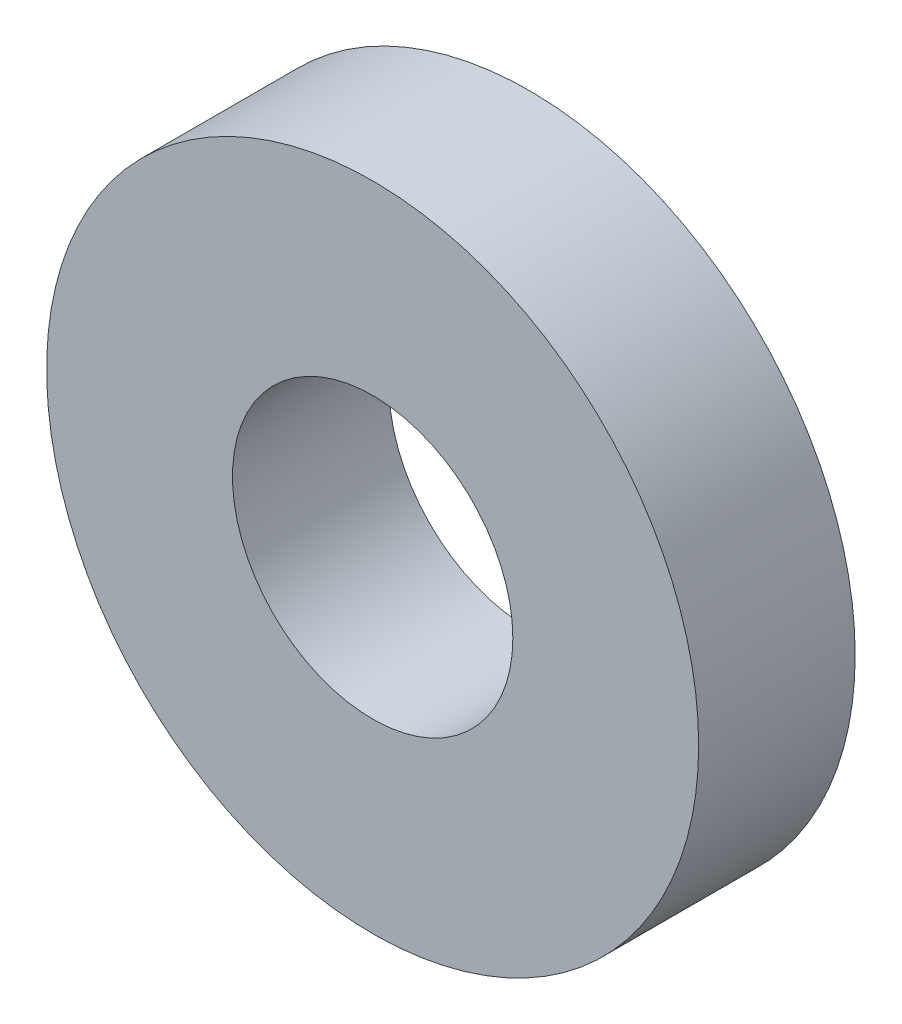
ISO-10303-21;
HEADER;
FILE_DESCRIPTION(('STEP AP214'),'2;1');
FILE_NAME('part.step','',(''),(''),'','','');
FILE_SCHEMA(('AUTOMOTIVE_DESIGN { 1 0 10303 214 1 1 1 1 }'));
ENDSEC;
DATA;
#1=APPLICATION_CONTEXT('core data for automotive mechanical design processes');
#2=APPLICATION_PROTOCOL_DEFINITION('international standard','automotive_design',2000,#1);
#3=PRODUCT_CONTEXT('',#1,'mechanical');
#4=PRODUCT('Part','Part','',(#3));
#5=PRODUCT_RELATED_PRODUCT_CATEGORY('part','',(#4));
#6=PRODUCT_DEFINITION_FORMATION('','',#4);
#7=PRODUCT_DEFINITION_CONTEXT('part definition',#1,'design');
#8=PRODUCT_DEFINITION('design','',#6,#7);
#9=PRODUCT_DEFINITION_SHAPE('','',#8);
#10=(LENGTH_UNIT() NAMED_UNIT(*) SI_UNIT(.MILLI.,.METRE.));
#11=(NAMED_UNIT(*) PLANE_ANGLE_UNIT() SI_UNIT($,.RADIAN.));
#12=(NAMED_UNIT(*) SI_UNIT($,.STERADIAN.) SOLID_ANGLE_UNIT());
#13=UNCERTAINTY_MEASURE_WITH_UNIT(LENGTH_MEASURE(1.E-05),#10,'distance_accuracy_value','');
#14=(GEOMETRIC_REPRESENTATION_CONTEXT(3) GLOBAL_UNCERTAINTY_ASSIGNED_CONTEXT((#13)) GLOBAL_UNIT_ASSIGNED_CONTEXT((#10,
#11,#12)) REPRESENTATION_CONTEXT('',''));
#15=CARTESIAN_POINT('',(0.,0.,0.));
#16=DIRECTION('',(0.,0.,1.));
#17=DIRECTION('',(1.,0.,0.));
#18=AXIS2_PLACEMENT_3D('',#15,#16,#17);
#19=CARTESIAN_POINT('',(0.,0.,2.4));
#20=DIRECTION('',(0.,0.,1.));
#21=DIRECTION('',(1.,0.,0.));
#22=AXIS2_PLACEMENT_3D('',#19,#20,#21);
#23=PLANE('',#22);
#24=CARTESIAN_POINT('',(0.,0.,2.4));
#25=DIRECTION('',(0.,0.,1.));
#26=DIRECTION('',(1.,0.,0.));
#27=AXIS2_PLACEMENT_3D('',#24,#25,#26);
#28=CIRCLE('',#27,5.);
#29=CARTESIAN_POINT('',(5.,0.,2.4));
#30=VERTEX_POINT('',#29);
#31=EDGE_CURVE('E10',#30,#30,#28,.T.);
#32=ORIENTED_EDGE('',*,*,#31,.T.);
#33=EDGE_LOOP('',(#32));
#34=FACE_BOUND('',#33,.T.);
#35=CARTESIAN_POINT('',(0.,0.,2.4));
#36=DIRECTION('',(0.,0.,1.));
#37=DIRECTION('',(1.,0.,0.));
#38=AXIS2_PLACEMENT_3D('',#35,#36,#37);
#39=CIRCLE('',#38,2.15);
#40=CARTESIAN_POINT('',(2.15,0.,2.4));
#41=VERTEX_POINT('',#40);
#42=EDGE_CURVE('E45',#41,#41,#39,.T.);
#43=ORIENTED_EDGE('',*,*,#42,.F.);
#44=EDGE_LOOP('',(#43));
#45=FACE_BOUND('',#44,.T.);
#46=ADVANCED_FACE('F34',(#34,#45),#23,.T.);
#47=CARTESIAN_POINT('',(0.,0.,0.));
#48=DIRECTION('',(0.,0.,1.));
#49=DIRECTION('',(1.,0.,0.));
#50=AXIS2_PLACEMENT_3D('',#47,#48,#49);
#51=PLANE('',#50);
#52=CARTESIAN_POINT('',(0.,0.,0.));
#53=DIRECTION('',(0.,0.,1.));
#54=DIRECTION('',(1.,0.,0.));
#55=AXIS2_PLACEMENT_3D('',#52,#53,#54);
#56=CIRCLE('',#55,5.);
#57=CARTESIAN_POINT('',(5.,0.,0.));
#58=VERTEX_POINT('',#57);
#59=EDGE_CURVE('E38',#58,#58,#56,.T.);
#60=ORIENTED_EDGE('',*,*,#59,.F.);
#61=EDGE_LOOP('',(#60));
#62=FACE_BOUND('',#61,.T.);
#63=CARTESIAN_POINT('',(0.,0.,0.));
#64=DIRECTION('',(0.,0.,1.));
#65=DIRECTION('',(1.,0.,0.));
#66=AXIS2_PLACEMENT_3D('',#63,#64,#65);
#67=CIRCLE('',#66,2.15);
#68=CARTESIAN_POINT('',(2.15,0.,0.));
#69=VERTEX_POINT('',#68);
#70=EDGE_CURVE('E47',#69,#69,#67,.T.);
#71=ORIENTED_EDGE('',*,*,#70,.T.);
#72=EDGE_LOOP('',(#71));
#73=FACE_BOUND('',#72,.T.);
#74=ADVANCED_FACE('F57',(#62,#73),#51,.F.);
#75=CARTESIAN_POINT('',(0.,0.,2.4));
#76=DIRECTION('',(0.,0.,-1.));
#77=DIRECTION('',(-1.,0.,0.));
#78=AXIS2_PLACEMENT_3D('',#75,#76,#77);
#79=CYLINDRICAL_SURFACE('',#78,5.);
#80=ORIENTED_EDGE('',*,*,#31,.F.);
#81=EDGE_LOOP('',(#80));
#82=FACE_BOUND('',#81,.T.);
#83=ORIENTED_EDGE('',*,*,#59,.T.);
#84=EDGE_LOOP('',(#83));
#85=FACE_BOUND('',#84,.T.);
#86=ADVANCED_FACE('F36',(#82,#85),#79,.T.);
#87=CARTESIAN_POINT('',(0.,0.,2.4));
#88=DIRECTION('',(0.,0.,-1.));
#89=DIRECTION('',(-1.,0.,0.));
#90=AXIS2_PLACEMENT_3D('',#87,#88,#89);
#91=CYLINDRICAL_SURFACE('',#90,2.15);
#92=ORIENTED_EDGE('',*,*,#42,.T.);
#93=EDGE_LOOP('',(#92));
#94=FACE_BOUND('',#93,.T.);
#95=ORIENTED_EDGE('',*,*,#70,.F.);
#96=EDGE_LOOP('',(#95));
#97=FACE_BOUND('',#96,.T.);
#98=ADVANCED_FACE('F53',(#94,#97),#91,.F.);
#99=CLOSED_SHELL('',(#46,#74,#86,#98));
#100=MANIFOLD_SOLID_BREP('B2',#99);
#101=ADVANCED_BREP_SHAPE_REPRESENTATION('',(#18,#100),#14);
#102=SHAPE_DEFINITION_REPRESENTATION(#9,#101);
ENDSEC;
END-ISO-10303-21;
